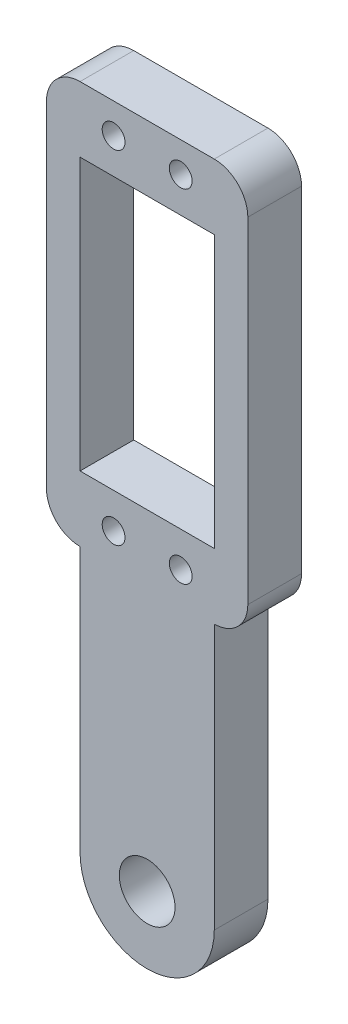
ISO-10303-21;
HEADER;
FILE_DESCRIPTION(('STEP AP214'),'2;1');
FILE_NAME('part.step','',(''),(''),'','','');
FILE_SCHEMA(('AUTOMOTIVE_DESIGN { 1 0 10303 214 1 1 1 1 }'));
ENDSEC;
DATA;
#1=APPLICATION_CONTEXT('core data for automotive mechanical design processes');
#2=APPLICATION_PROTOCOL_DEFINITION('international standard','automotive_design',2000,#1);
#3=PRODUCT_CONTEXT('',#1,'mechanical');
#4=PRODUCT('Part','Part','',(#3));
#5=PRODUCT_RELATED_PRODUCT_CATEGORY('part','',(#4));
#6=PRODUCT_DEFINITION_FORMATION('','',#4);
#7=PRODUCT_DEFINITION_CONTEXT('part definition',#1,'design');
#8=PRODUCT_DEFINITION('design','',#6,#7);
#9=PRODUCT_DEFINITION_SHAPE('','',#8);
#10=(LENGTH_UNIT() NAMED_UNIT(*) SI_UNIT(.MILLI.,.METRE.));
#11=(NAMED_UNIT(*) PLANE_ANGLE_UNIT() SI_UNIT($,.RADIAN.));
#12=(NAMED_UNIT(*) SI_UNIT($,.STERADIAN.) SOLID_ANGLE_UNIT());
#13=UNCERTAINTY_MEASURE_WITH_UNIT(LENGTH_MEASURE(1.E-05),#10,'distance_accuracy_value','');
#14=(GEOMETRIC_REPRESENTATION_CONTEXT(3) GLOBAL_UNCERTAINTY_ASSIGNED_CONTEXT((#13)) GLOBAL_UNIT_ASSIGNED_CONTEXT((#10,
#11,#12)) REPRESENTATION_CONTEXT('',''));
#15=CARTESIAN_POINT('',(0.,0.,0.));
#16=DIRECTION('',(0.,0.,1.));
#17=DIRECTION('',(1.,0.,0.));
#18=AXIS2_PLACEMENT_3D('',#15,#16,#17);
#19=CARTESIAN_POINT('',(0.,89.7500000000027,8.));
#20=DIRECTION('',(0.,1.00000000000004,0.));
#21=DIRECTION('',(0.,0.,1.));
#22=AXIS2_PLACEMENT_3D('',#19,#20,#21);
#23=PLANE('',#22);
#24=DIRECTION('',(1.00000000000004,0.,0.));
#25=VECTOR('',#24,1.);
#26=CARTESIAN_POINT('',(0.,89.7500000000027,0.));
#27=LINE('',#26,#25);
#28=CARTESIAN_POINT('',(-10.,89.7500000000027,0.));
#29=VERTEX_POINT('',#28);
#30=CARTESIAN_POINT('',(10.,89.7500000000027,0.));
#31=VERTEX_POINT('',#30);
#32=EDGE_CURVE('E222',#29,#31,#27,.T.);
#33=ORIENTED_EDGE('',*,*,#32,.T.);
#34=DIRECTION('',(0.,0.,-1.));
#35=VECTOR('',#34,1.);
#36=CARTESIAN_POINT('',(10.,89.7500000000027,8.));
#37=LINE('',#36,#35);
#38=CARTESIAN_POINT('',(10.,89.7500000000027,8.));
#39=VERTEX_POINT('',#38);
#40=EDGE_CURVE('E171',#39,#31,#37,.T.);
#41=ORIENTED_EDGE('',*,*,#40,.F.);
#42=DIRECTION('',(1.00000000000004,0.,0.));
#43=VECTOR('',#42,1.);
#44=CARTESIAN_POINT('',(0.,89.7500000000027,8.));
#45=LINE('',#44,#43);
#46=CARTESIAN_POINT('',(-10.,89.7500000000027,8.));
#47=VERTEX_POINT('',#46);
#48=EDGE_CURVE('E279',#47,#39,#45,.T.);
#49=ORIENTED_EDGE('',*,*,#48,.F.);
#50=DIRECTION('',(0.,0.,-1.));
#51=VECTOR('',#50,1.);
#52=CARTESIAN_POINT('',(-10.,89.7500000000027,8.));
#53=LINE('',#52,#51);
#54=EDGE_CURVE('E160',#47,#29,#53,.T.);
#55=ORIENTED_EDGE('',*,*,#54,.T.);
#56=EDGE_LOOP('',(#33,#41,#49,#55));
#57=FACE_BOUND('',#56,.T.);
#58=ADVANCED_FACE('F36',(#57),#23,.F.);
#59=CARTESIAN_POINT('',(10.,0.,8.));
#60=DIRECTION('',(1.00000000000004,0.,0.));
#61=DIRECTION('',(0.,0.,-1.));
#62=AXIS2_PLACEMENT_3D('',#59,#60,#61);
#63=PLANE('',#62);
#64=DIRECTION('',(0.,-1.00000000000004,0.));
#65=VECTOR('',#64,1.);
#66=CARTESIAN_POINT('',(10.,0.,0.));
#67=LINE('',#66,#65);
#68=CARTESIAN_POINT('',(10.,49.2500000000027,0.));
#69=VERTEX_POINT('',#68);
#70=EDGE_CURVE('E225',#31,#69,#67,.T.);
#71=ORIENTED_EDGE('',*,*,#70,.T.);
#72=DIRECTION('',(0.,0.,-1.));
#73=VECTOR('',#72,1.);
#74=CARTESIAN_POINT('',(10.,49.2500000000027,8.));
#75=LINE('',#74,#73);
#76=CARTESIAN_POINT('',(10.,49.2500000000027,8.));
#77=VERTEX_POINT('',#76);
#78=EDGE_CURVE('E242',#77,#69,#75,.T.);
#79=ORIENTED_EDGE('',*,*,#78,.F.);
#80=DIRECTION('',(0.,-1.00000000000004,0.));
#81=VECTOR('',#80,1.);
#82=CARTESIAN_POINT('',(10.,0.,8.));
#83=LINE('',#82,#81);
#84=EDGE_CURVE('E282',#39,#77,#83,.T.);
#85=ORIENTED_EDGE('',*,*,#84,.F.);
#86=ORIENTED_EDGE('',*,*,#40,.T.);
#87=EDGE_LOOP('',(#71,#79,#85,#86));
#88=FACE_BOUND('',#87,.T.);
#89=ADVANCED_FACE('F322',(#88),#63,.F.);
#90=CARTESIAN_POINT('',(0.,49.2500000000027,8.));
#91=DIRECTION('',(0.,1.00000000000004,0.));
#92=DIRECTION('',(0.,0.,1.));
#93=AXIS2_PLACEMENT_3D('',#90,#91,#92);
#94=PLANE('',#93);
#95=DIRECTION('',(1.00000000000004,0.,0.));
#96=VECTOR('',#95,1.);
#97=CARTESIAN_POINT('',(0.,49.2500000000027,0.));
#98=LINE('',#97,#96);
#99=CARTESIAN_POINT('',(-10.,49.2500000000027,0.));
#100=VERTEX_POINT('',#99);
#101=EDGE_CURVE('E228',#100,#69,#98,.T.);
#102=ORIENTED_EDGE('',*,*,#101,.F.);
#103=DIRECTION('',(0.,0.,-1.));
#104=VECTOR('',#103,1.);
#105=CARTESIAN_POINT('',(-10.,49.2500000000027,8.));
#106=LINE('',#105,#104);
#107=CARTESIAN_POINT('',(-10.,49.2500000000027,8.));
#108=VERTEX_POINT('',#107);
#109=EDGE_CURVE('E162',#108,#100,#106,.T.);
#110=ORIENTED_EDGE('',*,*,#109,.F.);
#111=DIRECTION('',(1.00000000000004,0.,0.));
#112=VECTOR('',#111,1.);
#113=CARTESIAN_POINT('',(0.,49.2500000000027,8.));
#114=LINE('',#113,#112);
#115=EDGE_CURVE('E284',#108,#77,#114,.T.);
#116=ORIENTED_EDGE('',*,*,#115,.T.);
#117=ORIENTED_EDGE('',*,*,#78,.T.);
#118=EDGE_LOOP('',(#102,#110,#116,#117));
#119=FACE_BOUND('',#118,.T.);
#120=ADVANCED_FACE('F328',(#119),#94,.T.);
#121=CARTESIAN_POINT('',(15.,0.,8.));
#122=DIRECTION('',(1.00000000000004,0.,0.));
#123=DIRECTION('',(0.,0.,-1.));
#124=AXIS2_PLACEMENT_3D('',#121,#122,#123);
#125=PLANE('',#124);
#126=DIRECTION('',(0.,-1.00000000000004,0.));
#127=VECTOR('',#126,1.);
#128=CARTESIAN_POINT('',(15.,0.,8.));
#129=LINE('',#128,#127);
#130=CARTESIAN_POINT('',(15.,94.5000000000041,8.));
#131=VERTEX_POINT('',#130);
#132=CARTESIAN_POINT('',(15.,44.5000000000014,8.));
#133=VERTEX_POINT('',#132);
#134=EDGE_CURVE('E267',#131,#133,#129,.T.);
#135=ORIENTED_EDGE('',*,*,#134,.T.);
#136=DIRECTION('',(0.,0.,-1.));
#137=VECTOR('',#136,1.);
#138=CARTESIAN_POINT('',(15.,44.5000000000014,0.));
#139=LINE('',#138,#137);
#140=CARTESIAN_POINT('',(15.,44.5000000000014,0.));
#141=VERTEX_POINT('',#140);
#142=EDGE_CURVE('E170',#133,#141,#139,.T.);
#143=ORIENTED_EDGE('',*,*,#142,.T.);
#144=DIRECTION('',(0.,-1.00000000000004,0.));
#145=VECTOR('',#144,1.);
#146=CARTESIAN_POINT('',(15.,0.,0.));
#147=LINE('',#146,#145);
#148=CARTESIAN_POINT('',(15.,94.5000000000041,0.));
#149=VERTEX_POINT('',#148);
#150=EDGE_CURVE('E207',#149,#141,#147,.T.);
#151=ORIENTED_EDGE('',*,*,#150,.F.);
#152=DIRECTION('',(0.,0.,-1.));
#153=VECTOR('',#152,1.);
#154=CARTESIAN_POINT('',(15.,94.5000000000041,8.));
#155=LINE('',#154,#153);
#156=EDGE_CURVE('E168',#149,#131,#155,.F.);
#157=ORIENTED_EDGE('',*,*,#156,.T.);
#158=EDGE_LOOP('',(#135,#143,#151,#157));
#159=FACE_BOUND('',#158,.T.);
#160=ADVANCED_FACE('F264',(#159),#125,.T.);
#161=CARTESIAN_POINT('',(0.,99.5000000000054,8.));
#162=DIRECTION('',(0.,1.00000000000004,0.));
#163=DIRECTION('',(0.,0.,1.));
#164=AXIS2_PLACEMENT_3D('',#161,#162,#163);
#165=PLANE('',#164);
#166=DIRECTION('',(1.00000000000004,0.,0.));
#167=VECTOR('',#166,1.);
#168=CARTESIAN_POINT('',(0.,99.5000000000054,0.));
#169=LINE('',#168,#167);
#170=CARTESIAN_POINT('',(-10.,99.5000000000054,0.));
#171=VERTEX_POINT('',#170);
#172=CARTESIAN_POINT('',(10.,99.5000000000054,0.));
#173=VERTEX_POINT('',#172);
#174=EDGE_CURVE('E195',#171,#173,#169,.T.);
#175=ORIENTED_EDGE('',*,*,#174,.F.);
#176=DIRECTION('',(0.,0.,-1.));
#177=VECTOR('',#176,1.);
#178=CARTESIAN_POINT('',(-10.,99.5000000000054,8.));
#179=LINE('',#178,#177);
#180=CARTESIAN_POINT('',(-10.,99.5000000000054,8.));
#181=VERTEX_POINT('',#180);
#182=EDGE_CURVE('E11',#171,#181,#179,.F.);
#183=ORIENTED_EDGE('',*,*,#182,.T.);
#184=DIRECTION('',(1.00000000000004,0.,0.));
#185=VECTOR('',#184,1.);
#186=CARTESIAN_POINT('',(0.,99.5000000000054,8.));
#187=LINE('',#186,#185);
#188=CARTESIAN_POINT('',(10.,99.5000000000054,8.));
#189=VERTEX_POINT('',#188);
#190=EDGE_CURVE('E197',#181,#189,#187,.T.);
#191=ORIENTED_EDGE('',*,*,#190,.T.);
#192=DIRECTION('',(0.,0.,-1.));
#193=VECTOR('',#192,1.);
#194=CARTESIAN_POINT('',(10.,99.5000000000054,8.));
#195=LINE('',#194,#193);
#196=EDGE_CURVE('E44',#189,#173,#195,.T.);
#197=ORIENTED_EDGE('',*,*,#196,.T.);
#198=EDGE_LOOP('',(#175,#183,#191,#197));
#199=FACE_BOUND('',#198,.T.);
#200=ADVANCED_FACE('F194',(#199),#165,.T.);
#201=CARTESIAN_POINT('',(-15.,0.,8.));
#202=DIRECTION('',(1.00000000000004,0.,0.));
#203=DIRECTION('',(0.,0.,-1.));
#204=AXIS2_PLACEMENT_3D('',#201,#202,#203);
#205=PLANE('',#204);
#206=DIRECTION('',(0.,-1.00000000000004,0.));
#207=VECTOR('',#206,1.);
#208=CARTESIAN_POINT('',(-15.,0.,0.));
#209=LINE('',#208,#207);
#210=CARTESIAN_POINT('',(-15.,94.5000000000041,0.));
#211=VERTEX_POINT('',#210);
#212=CARTESIAN_POINT('',(-15.,44.5000000000014,0.));
#213=VERTEX_POINT('',#212);
#214=EDGE_CURVE('E206',#211,#213,#209,.T.);
#215=ORIENTED_EDGE('',*,*,#214,.T.);
#216=DIRECTION('',(0.,0.,-1.));
#217=VECTOR('',#216,1.);
#218=CARTESIAN_POINT('',(-15.,44.5000000000014,8.));
#219=LINE('',#218,#217);
#220=CARTESIAN_POINT('',(-15.,44.5000000000014,8.));
#221=VERTEX_POINT('',#220);
#222=EDGE_CURVE('E51',#213,#221,#219,.F.);
#223=ORIENTED_EDGE('',*,*,#222,.T.);
#224=DIRECTION('',(0.,-1.00000000000004,0.));
#225=VECTOR('',#224,1.);
#226=CARTESIAN_POINT('',(-15.,0.,8.));
#227=LINE('',#226,#225);
#228=CARTESIAN_POINT('',(-15.,94.5000000000041,8.));
#229=VERTEX_POINT('',#228);
#230=EDGE_CURVE('E143',#229,#221,#227,.T.);
#231=ORIENTED_EDGE('',*,*,#230,.F.);
#232=DIRECTION('',(0.,0.,-1.));
#233=VECTOR('',#232,1.);
#234=CARTESIAN_POINT('',(-15.,94.5000000000041,0.));
#235=LINE('',#234,#233);
#236=EDGE_CURVE('E185',#229,#211,#235,.T.);
#237=ORIENTED_EDGE('',*,*,#236,.T.);
#238=EDGE_LOOP('',(#215,#223,#231,#237));
#239=FACE_BOUND('',#238,.T.);
#240=ADVANCED_FACE('F339',(#239),#205,.F.);
#241=CARTESIAN_POINT('',(-10.,0.,8.));
#242=DIRECTION('',(-1.00000000000004,0.,0.));
#243=DIRECTION('',(0.,0.,1.));
#244=AXIS2_PLACEMENT_3D('',#241,#242,#243);
#245=PLANE('',#244);
#246=DIRECTION('',(0.,1.00000000000004,0.));
#247=VECTOR('',#246,1.);
#248=CARTESIAN_POINT('',(-10.,0.,0.));
#249=LINE('',#248,#247);
#250=CARTESIAN_POINT('',(-10.,0.,0.));
#251=VERTEX_POINT('',#250);
#252=CARTESIAN_POINT('',(-10.,39.5000000000014,0.));
#253=VERTEX_POINT('',#252);
#254=EDGE_CURVE('E209',#251,#253,#249,.T.);
#255=ORIENTED_EDGE('',*,*,#254,.F.);
#256=DIRECTION('',(0.,0.,-1.));
#257=VECTOR('',#256,1.);
#258=CARTESIAN_POINT('',(-10.,0.,8.));
#259=LINE('',#258,#257);
#260=CARTESIAN_POINT('',(-10.,0.,8.));
#261=VERTEX_POINT('',#260);
#262=EDGE_CURVE('E154',#261,#251,#259,.T.);
#263=ORIENTED_EDGE('',*,*,#262,.F.);
#264=DIRECTION('',(0.,1.00000000000004,0.));
#265=VECTOR('',#264,1.);
#266=CARTESIAN_POINT('',(-10.,0.,8.));
#267=LINE('',#266,#265);
#268=CARTESIAN_POINT('',(-10.,39.5000000000014,8.));
#269=VERTEX_POINT('',#268);
#270=EDGE_CURVE('E142',#261,#269,#267,.T.);
#271=ORIENTED_EDGE('',*,*,#270,.T.);
#272=DIRECTION('',(0.,0.,-1.));
#273=VECTOR('',#272,1.);
#274=CARTESIAN_POINT('',(-10.,39.5000000000014,8.));
#275=LINE('',#274,#273);
#276=EDGE_CURVE('E152',#269,#253,#275,.T.);
#277=ORIENTED_EDGE('',*,*,#276,.T.);
#278=EDGE_LOOP('',(#255,#263,#271,#277));
#279=FACE_BOUND('',#278,.T.);
#280=ADVANCED_FACE('F151',(#279),#245,.T.);
#281=CARTESIAN_POINT('',(0.,0.,8.));
#282=DIRECTION('',(0.,0.,-1.));
#283=DIRECTION('',(-1.00000000000004,0.,0.));
#284=AXIS2_PLACEMENT_3D('',#281,#282,#283);
#285=CYLINDRICAL_SURFACE('',#284,10.);
#286=CARTESIAN_POINT('',(0.,0.,0.));
#287=DIRECTION('',(0.,0.,1.));
#288=DIRECTION('',(1.00000000000004,0.,0.));
#289=AXIS2_PLACEMENT_3D('',#286,#287,#288);
#290=CIRCLE('',#289,10.);
#291=CARTESIAN_POINT('',(10.,0.,0.));
#292=VERTEX_POINT('',#291);
#293=EDGE_CURVE('E216',#251,#292,#290,.T.);
#294=ORIENTED_EDGE('',*,*,#293,.T.);
#295=DIRECTION('',(0.,0.,-1.));
#296=VECTOR('',#295,1.);
#297=CARTESIAN_POINT('',(10.,0.,8.));
#298=LINE('',#297,#296);
#299=CARTESIAN_POINT('',(10.,0.,8.));
#300=VERTEX_POINT('',#299);
#301=EDGE_CURVE('E164',#300,#292,#298,.T.);
#302=ORIENTED_EDGE('',*,*,#301,.F.);
#303=CARTESIAN_POINT('',(0.,0.,8.));
#304=DIRECTION('',(0.,0.,1.));
#305=DIRECTION('',(1.00000000000004,0.,0.));
#306=AXIS2_PLACEMENT_3D('',#303,#304,#305);
#307=CIRCLE('',#306,10.);
#308=EDGE_CURVE('E156',#261,#300,#307,.T.);
#309=ORIENTED_EDGE('',*,*,#308,.F.);
#310=ORIENTED_EDGE('',*,*,#262,.T.);
#311=EDGE_LOOP('',(#294,#302,#309,#310));
#312=FACE_BOUND('',#311,.T.);
#313=ADVANCED_FACE('F257',(#312),#285,.T.);
#314=CARTESIAN_POINT('',(10.,0.,8.));
#315=DIRECTION('',(-1.00000000000004,0.,0.));
#316=DIRECTION('',(0.,0.,1.));
#317=AXIS2_PLACEMENT_3D('',#314,#315,#316);
#318=PLANE('',#317);
#319=DIRECTION('',(0.,1.00000000000004,0.));
#320=VECTOR('',#319,1.);
#321=CARTESIAN_POINT('',(10.,0.,0.));
#322=LINE('',#321,#320);
#323=CARTESIAN_POINT('',(10.,39.5000000000014,0.));
#324=VERTEX_POINT('',#323);
#325=EDGE_CURVE('E219',#292,#324,#322,.T.);
#326=ORIENTED_EDGE('',*,*,#325,.T.);
#327=DIRECTION('',(0.,0.,-1.));
#328=VECTOR('',#327,1.);
#329=CARTESIAN_POINT('',(10.,39.5000000000014,8.));
#330=LINE('',#329,#328);
#331=CARTESIAN_POINT('',(10.,39.5000000000014,8.));
#332=VERTEX_POINT('',#331);
#333=EDGE_CURVE('E246',#332,#324,#330,.T.);
#334=ORIENTED_EDGE('',*,*,#333,.F.);
#335=DIRECTION('',(0.,1.00000000000004,0.));
#336=VECTOR('',#335,1.);
#337=CARTESIAN_POINT('',(10.,0.,8.));
#338=LINE('',#337,#336);
#339=EDGE_CURVE('E254',#300,#332,#338,.T.);
#340=ORIENTED_EDGE('',*,*,#339,.F.);
#341=ORIENTED_EDGE('',*,*,#301,.T.);
#342=EDGE_LOOP('',(#326,#334,#340,#341));
#343=FACE_BOUND('',#342,.T.);
#344=ADVANCED_FACE('F252',(#343),#318,.F.);
#345=CARTESIAN_POINT('',(5.,44.0000000000013,8.));
#346=DIRECTION('',(0.,0.,-1.));
#347=DIRECTION('',(-1.00000000000004,0.,0.));
#348=AXIS2_PLACEMENT_3D('',#345,#346,#347);
#349=CYLINDRICAL_SURFACE('',#348,1.7);
#350=CARTESIAN_POINT('',(5.,44.0000000000013,8.));
#351=DIRECTION('',(0.,0.,1.));
#352=DIRECTION('',(1.00000000000004,0.,0.));
#353=AXIS2_PLACEMENT_3D('',#350,#351,#352);
#354=CIRCLE('',#353,1.7);
#355=CARTESIAN_POINT('',(6.70000000000008,44.0000000000013,8.));
#356=VERTEX_POINT('',#355);
#357=EDGE_CURVE('E290',#356,#356,#354,.F.);
#358=ORIENTED_EDGE('',*,*,#357,.F.);
#359=EDGE_LOOP('',(#358));
#360=FACE_BOUND('',#359,.T.);
#361=CARTESIAN_POINT('',(5.,44.0000000000013,0.));
#362=DIRECTION('',(0.,0.,1.));
#363=DIRECTION('',(1.00000000000004,0.,0.));
#364=AXIS2_PLACEMENT_3D('',#361,#362,#363);
#365=CIRCLE('',#364,1.7);
#366=CARTESIAN_POINT('',(6.70000000000008,44.0000000000013,0.));
#367=VERTEX_POINT('',#366);
#368=EDGE_CURVE('E234',#367,#367,#365,.F.);
#369=ORIENTED_EDGE('',*,*,#368,.T.);
#370=EDGE_LOOP('',(#369));
#371=FACE_BOUND('',#370,.T.);
#372=ADVANCED_FACE('F317',(#360,#371),#349,.F.);
#373=CARTESIAN_POINT('',(-10.,0.,8.));
#374=DIRECTION('',(1.00000000000004,0.,0.));
#375=DIRECTION('',(0.,0.,-1.));
#376=AXIS2_PLACEMENT_3D('',#373,#374,#375);
#377=PLANE('',#376);
#378=DIRECTION('',(0.,-1.00000000000004,0.));
#379=VECTOR('',#378,1.);
#380=CARTESIAN_POINT('',(-10.,0.,0.));
#381=LINE('',#380,#379);
#382=EDGE_CURVE('E231',#29,#100,#381,.T.);
#383=ORIENTED_EDGE('',*,*,#382,.F.);
#384=ORIENTED_EDGE('',*,*,#54,.F.);
#385=DIRECTION('',(0.,-1.00000000000004,0.));
#386=VECTOR('',#385,1.);
#387=CARTESIAN_POINT('',(-10.,0.,8.));
#388=LINE('',#387,#386);
#389=EDGE_CURVE('E287',#47,#108,#388,.T.);
#390=ORIENTED_EDGE('',*,*,#389,.T.);
#391=ORIENTED_EDGE('',*,*,#109,.T.);
#392=EDGE_LOOP('',(#383,#384,#390,#391));
#393=FACE_BOUND('',#392,.T.);
#394=ADVANCED_FACE('F307',(#393),#377,.T.);
#395=CARTESIAN_POINT('',(-5.,95.0000000000041,8.));
#396=DIRECTION('',(0.,0.,-1.));
#397=DIRECTION('',(-1.00000000000004,0.,0.));
#398=AXIS2_PLACEMENT_3D('',#395,#396,#397);
#399=CYLINDRICAL_SURFACE('',#398,1.7);
#400=CARTESIAN_POINT('',(-5.,95.0000000000041,8.));
#401=DIRECTION('',(0.,0.,1.));
#402=DIRECTION('',(1.00000000000004,0.,0.));
#403=AXIS2_PLACEMENT_3D('',#400,#401,#402);
#404=CIRCLE('',#403,1.7);
#405=CARTESIAN_POINT('',(-3.29999999999993,95.0000000000041,8.));
#406=VERTEX_POINT('',#405);
#407=EDGE_CURVE('E268',#406,#406,#404,.T.);
#408=ORIENTED_EDGE('',*,*,#407,.T.);
#409=EDGE_LOOP('',(#408));
#410=FACE_BOUND('',#409,.T.);
#411=CARTESIAN_POINT('',(-5.,95.0000000000041,0.));
#412=DIRECTION('',(0.,0.,1.));
#413=DIRECTION('',(1.00000000000004,0.,0.));
#414=AXIS2_PLACEMENT_3D('',#411,#412,#413);
#415=CIRCLE('',#414,1.7);
#416=CARTESIAN_POINT('',(-3.29999999999993,95.0000000000041,0.));
#417=VERTEX_POINT('',#416);
#418=EDGE_CURVE('E211',#417,#417,#415,.T.);
#419=ORIENTED_EDGE('',*,*,#418,.F.);
#420=EDGE_LOOP('',(#419));
#421=FACE_BOUND('',#420,.T.);
#422=ADVANCED_FACE('F304',(#410,#421),#399,.F.);
#423=CARTESIAN_POINT('',(5.,95.0000000000041,8.));
#424=DIRECTION('',(0.,0.,-1.));
#425=DIRECTION('',(-1.00000000000004,0.,0.));
#426=AXIS2_PLACEMENT_3D('',#423,#424,#425);
#427=CYLINDRICAL_SURFACE('',#426,1.7);
#428=CARTESIAN_POINT('',(5.,95.0000000000041,8.));
#429=DIRECTION('',(0.,0.,1.));
#430=DIRECTION('',(1.00000000000004,0.,0.));
#431=AXIS2_PLACEMENT_3D('',#428,#429,#430);
#432=CIRCLE('',#431,1.7);
#433=CARTESIAN_POINT('',(6.70000000000008,95.0000000000041,8.));
#434=VERTEX_POINT('',#433);
#435=EDGE_CURVE('E272',#434,#434,#432,.T.);
#436=ORIENTED_EDGE('',*,*,#435,.T.);
#437=EDGE_LOOP('',(#436));
#438=FACE_BOUND('',#437,.T.);
#439=CARTESIAN_POINT('',(5.,95.0000000000041,0.));
#440=DIRECTION('',(0.,0.,1.));
#441=DIRECTION('',(1.00000000000004,0.,0.));
#442=AXIS2_PLACEMENT_3D('',#439,#440,#441);
#443=CIRCLE('',#442,1.7);
#444=CARTESIAN_POINT('',(6.70000000000008,95.0000000000041,0.));
#445=VERTEX_POINT('',#444);
#446=EDGE_CURVE('E298',#445,#445,#443,.T.);
#447=ORIENTED_EDGE('',*,*,#446,.F.);
#448=EDGE_LOOP('',(#447));
#449=FACE_BOUND('',#448,.T.);
#450=ADVANCED_FACE('F306',(#438,#449),#427,.F.);
#451=CARTESIAN_POINT('',(-5.,44.0000000000013,8.));
#452=DIRECTION('',(0.,0.,-1.));
#453=DIRECTION('',(-1.00000000000004,0.,0.));
#454=AXIS2_PLACEMENT_3D('',#451,#452,#453);
#455=CYLINDRICAL_SURFACE('',#454,1.7);
#456=CARTESIAN_POINT('',(-5.,44.0000000000013,8.));
#457=DIRECTION('',(0.,0.,1.));
#458=DIRECTION('',(1.00000000000004,0.,0.));
#459=AXIS2_PLACEMENT_3D('',#456,#457,#458);
#460=CIRCLE('',#459,1.7);
#461=CARTESIAN_POINT('',(-3.29999999999993,44.0000000000013,8.));
#462=VERTEX_POINT('',#461);
#463=EDGE_CURVE('E239',#462,#462,#460,.F.);
#464=ORIENTED_EDGE('',*,*,#463,.F.);
#465=EDGE_LOOP('',(#464));
#466=FACE_BOUND('',#465,.T.);
#467=CARTESIAN_POINT('',(-5.,44.0000000000013,0.));
#468=DIRECTION('',(0.,0.,1.));
#469=DIRECTION('',(1.00000000000004,0.,0.));
#470=AXIS2_PLACEMENT_3D('',#467,#468,#469);
#471=CIRCLE('',#470,1.7);
#472=CARTESIAN_POINT('',(-3.29999999999993,44.0000000000013,0.));
#473=VERTEX_POINT('',#472);
#474=EDGE_CURVE('E295',#473,#473,#471,.F.);
#475=ORIENTED_EDGE('',*,*,#474,.T.);
#476=EDGE_LOOP('',(#475));
#477=FACE_BOUND('',#476,.T.);
#478=ADVANCED_FACE('F314',(#466,#477),#455,.F.);
#479=CARTESIAN_POINT('',(0.,0.,8.));
#480=DIRECTION('',(0.,0.,-1.));
#481=DIRECTION('',(-1.00000000000004,0.,0.));
#482=AXIS2_PLACEMENT_3D('',#479,#480,#481);
#483=CYLINDRICAL_SURFACE('',#482,4.15);
#484=CARTESIAN_POINT('',(0.,0.,8.));
#485=DIRECTION('',(0.,0.,1.));
#486=DIRECTION('',(1.00000000000004,0.,0.));
#487=AXIS2_PLACEMENT_3D('',#484,#485,#486);
#488=CIRCLE('',#487,4.15);
#489=CARTESIAN_POINT('',(4.15000000000018,0.,8.));
#490=VERTEX_POINT('',#489);
#491=EDGE_CURVE('E248',#490,#490,#488,.T.);
#492=ORIENTED_EDGE('',*,*,#491,.T.);
#493=EDGE_LOOP('',(#492));
#494=FACE_BOUND('',#493,.T.);
#495=CARTESIAN_POINT('',(0.,0.,0.));
#496=DIRECTION('',(0.,0.,1.));
#497=DIRECTION('',(1.00000000000004,0.,0.));
#498=AXIS2_PLACEMENT_3D('',#495,#496,#497);
#499=CIRCLE('',#498,4.15);
#500=CARTESIAN_POINT('',(4.15000000000018,0.,0.));
#501=VERTEX_POINT('',#500);
#502=EDGE_CURVE('E237',#501,#501,#499,.T.);
#503=ORIENTED_EDGE('',*,*,#502,.F.);
#504=EDGE_LOOP('',(#503));
#505=FACE_BOUND('',#504,.T.);
#506=ADVANCED_FACE('F355',(#494,#505),#483,.F.);
#507=CARTESIAN_POINT('',(0.,0.,8.));
#508=DIRECTION('',(0.,0.,1.));
#509=DIRECTION('',(1.00000000000004,0.,0.));
#510=AXIS2_PLACEMENT_3D('',#507,#508,#509);
#511=PLANE('',#510);
#512=ORIENTED_EDGE('',*,*,#463,.T.);
#513=EDGE_LOOP('',(#512));
#514=FACE_BOUND('',#513,.T.);
#515=ORIENTED_EDGE('',*,*,#435,.F.);
#516=EDGE_LOOP('',(#515));
#517=FACE_BOUND('',#516,.T.);
#518=ORIENTED_EDGE('',*,*,#407,.F.);
#519=EDGE_LOOP('',(#518));
#520=FACE_BOUND('',#519,.T.);
#521=ORIENTED_EDGE('',*,*,#339,.T.);
#522=CARTESIAN_POINT('',(10.,44.5000000000014,8.));
#523=DIRECTION('',(0.,0.,1.));
#524=DIRECTION('',(1.00000000000004,0.,0.));
#525=AXIS2_PLACEMENT_3D('',#522,#523,#524);
#526=CIRCLE('',#525,5.);
#527=EDGE_CURVE('E146',#332,#133,#526,.T.);
#528=ORIENTED_EDGE('',*,*,#527,.T.);
#529=ORIENTED_EDGE('',*,*,#134,.F.);
#530=CARTESIAN_POINT('',(10.,94.5000000000041,8.));
#531=DIRECTION('',(0.,0.,1.));
#532=DIRECTION('',(1.00000000000004,0.,0.));
#533=AXIS2_PLACEMENT_3D('',#530,#531,#532);
#534=CIRCLE('',#533,5.);
#535=EDGE_CURVE('E181',#131,#189,#534,.T.);
#536=ORIENTED_EDGE('',*,*,#535,.T.);
#537=ORIENTED_EDGE('',*,*,#190,.F.);
#538=CARTESIAN_POINT('',(-10.,94.5000000000041,8.));
#539=DIRECTION('',(0.,0.,1.));
#540=DIRECTION('',(1.00000000000004,0.,0.));
#541=AXIS2_PLACEMENT_3D('',#538,#539,#540);
#542=CIRCLE('',#541,5.);
#543=EDGE_CURVE('E58',#181,#229,#542,.T.);
#544=ORIENTED_EDGE('',*,*,#543,.T.);
#545=ORIENTED_EDGE('',*,*,#230,.T.);
#546=CARTESIAN_POINT('',(-10.,44.5000000000014,8.));
#547=DIRECTION('',(0.,0.,1.));
#548=DIRECTION('',(1.00000000000004,0.,0.));
#549=AXIS2_PLACEMENT_3D('',#546,#547,#548);
#550=CIRCLE('',#549,5.);
#551=EDGE_CURVE('E137',#221,#269,#550,.T.);
#552=ORIENTED_EDGE('',*,*,#551,.T.);
#553=ORIENTED_EDGE('',*,*,#270,.F.);
#554=ORIENTED_EDGE('',*,*,#308,.T.);
#555=EDGE_LOOP('',(#521,#528,#529,#536,#537,#544,#545,#552,#553,#554));
#556=FACE_BOUND('',#555,.T.);
#557=ORIENTED_EDGE('',*,*,#48,.T.);
#558=ORIENTED_EDGE('',*,*,#84,.T.);
#559=ORIENTED_EDGE('',*,*,#115,.F.);
#560=ORIENTED_EDGE('',*,*,#389,.F.);
#561=EDGE_LOOP('',(#557,#558,#559,#560));
#562=FACE_BOUND('',#561,.T.);
#563=ORIENTED_EDGE('',*,*,#357,.T.);
#564=EDGE_LOOP('',(#563));
#565=FACE_BOUND('',#564,.T.);
#566=ORIENTED_EDGE('',*,*,#491,.F.);
#567=EDGE_LOOP('',(#566));
#568=FACE_BOUND('',#567,.T.);
#569=ADVANCED_FACE('F139',(#514,#517,#520,#556,#562,#565,#568),#511,.T.);
#570=CARTESIAN_POINT('',(0.,0.,0.));
#571=DIRECTION('',(0.,0.,1.));
#572=DIRECTION('',(1.00000000000004,0.,0.));
#573=AXIS2_PLACEMENT_3D('',#570,#571,#572);
#574=PLANE('',#573);
#575=ORIENTED_EDGE('',*,*,#474,.F.);
#576=EDGE_LOOP('',(#575));
#577=FACE_BOUND('',#576,.T.);
#578=ORIENTED_EDGE('',*,*,#446,.T.);
#579=EDGE_LOOP('',(#578));
#580=FACE_BOUND('',#579,.T.);
#581=ORIENTED_EDGE('',*,*,#418,.T.);
#582=EDGE_LOOP('',(#581));
#583=FACE_BOUND('',#582,.T.);
#584=ORIENTED_EDGE('',*,*,#150,.T.);
#585=CARTESIAN_POINT('',(10.,44.5000000000014,0.));
#586=DIRECTION('',(0.,0.,1.));
#587=DIRECTION('',(1.00000000000004,0.,0.));
#588=AXIS2_PLACEMENT_3D('',#585,#586,#587);
#589=CIRCLE('',#588,5.);
#590=EDGE_CURVE('E179',#141,#324,#589,.F.);
#591=ORIENTED_EDGE('',*,*,#590,.T.);
#592=ORIENTED_EDGE('',*,*,#325,.F.);
#593=ORIENTED_EDGE('',*,*,#293,.F.);
#594=ORIENTED_EDGE('',*,*,#254,.T.);
#595=CARTESIAN_POINT('',(-10.,44.5000000000014,0.));
#596=DIRECTION('',(0.,0.,1.));
#597=DIRECTION('',(1.00000000000004,0.,0.));
#598=AXIS2_PLACEMENT_3D('',#595,#596,#597);
#599=CIRCLE('',#598,5.);
#600=EDGE_CURVE('E159',#253,#213,#599,.F.);
#601=ORIENTED_EDGE('',*,*,#600,.T.);
#602=ORIENTED_EDGE('',*,*,#214,.F.);
#603=CARTESIAN_POINT('',(-10.,94.5000000000041,0.));
#604=DIRECTION('',(0.,0.,1.));
#605=DIRECTION('',(1.00000000000004,0.,0.));
#606=AXIS2_PLACEMENT_3D('',#603,#604,#605);
#607=CIRCLE('',#606,5.);
#608=EDGE_CURVE('E176',#211,#171,#607,.F.);
#609=ORIENTED_EDGE('',*,*,#608,.T.);
#610=ORIENTED_EDGE('',*,*,#174,.T.);
#611=CARTESIAN_POINT('',(10.,94.5000000000041,0.));
#612=DIRECTION('',(0.,0.,1.));
#613=DIRECTION('',(1.00000000000004,0.,0.));
#614=AXIS2_PLACEMENT_3D('',#611,#612,#613);
#615=CIRCLE('',#614,5.);
#616=EDGE_CURVE('E174',#173,#149,#615,.F.);
#617=ORIENTED_EDGE('',*,*,#616,.T.);
#618=EDGE_LOOP('',(#584,#591,#592,#593,#594,#601,#602,#609,#610,#617));
#619=FACE_BOUND('',#618,.T.);
#620=ORIENTED_EDGE('',*,*,#32,.F.);
#621=ORIENTED_EDGE('',*,*,#382,.T.);
#622=ORIENTED_EDGE('',*,*,#101,.T.);
#623=ORIENTED_EDGE('',*,*,#70,.F.);
#624=EDGE_LOOP('',(#620,#621,#622,#623));
#625=FACE_BOUND('',#624,.T.);
#626=ORIENTED_EDGE('',*,*,#368,.F.);
#627=EDGE_LOOP('',(#626));
#628=FACE_BOUND('',#627,.T.);
#629=ORIENTED_EDGE('',*,*,#502,.T.);
#630=EDGE_LOOP('',(#629));
#631=FACE_BOUND('',#630,.T.);
#632=ADVANCED_FACE('F202',(#577,#580,#583,#619,#625,#628,#631),#574,.F.);
#633=CARTESIAN_POINT('',(10.,44.5000000000014,8.));
#634=DIRECTION('',(0.,0.,1.));
#635=DIRECTION('',(1.00000000000004,0.,0.));
#636=AXIS2_PLACEMENT_3D('',#633,#634,#635);
#637=CYLINDRICAL_SURFACE('',#636,5.);
#638=ORIENTED_EDGE('',*,*,#527,.F.);
#639=ORIENTED_EDGE('',*,*,#333,.T.);
#640=ORIENTED_EDGE('',*,*,#590,.F.);
#641=ORIENTED_EDGE('',*,*,#142,.F.);
#642=EDGE_LOOP('',(#638,#639,#640,#641));
#643=FACE_BOUND('',#642,.T.);
#644=ADVANCED_FACE('F261',(#643),#637,.T.);
#645=CARTESIAN_POINT('',(-10.,44.5000000000014,8.));
#646=DIRECTION('',(0.,0.,-1.));
#647=DIRECTION('',(-1.00000000000004,0.,0.));
#648=AXIS2_PLACEMENT_3D('',#645,#646,#647);
#649=CYLINDRICAL_SURFACE('',#648,5.);
#650=ORIENTED_EDGE('',*,*,#551,.F.);
#651=ORIENTED_EDGE('',*,*,#222,.F.);
#652=ORIENTED_EDGE('',*,*,#600,.F.);
#653=ORIENTED_EDGE('',*,*,#276,.F.);
#654=EDGE_LOOP('',(#650,#651,#652,#653));
#655=FACE_BOUND('',#654,.T.);
#656=ADVANCED_FACE('F158',(#655),#649,.T.);
#657=CARTESIAN_POINT('',(-10.,94.5000000000041,8.));
#658=DIRECTION('',(0.,0.,1.));
#659=DIRECTION('',(1.00000000000004,0.,0.));
#660=AXIS2_PLACEMENT_3D('',#657,#658,#659);
#661=CYLINDRICAL_SURFACE('',#660,5.);
#662=ORIENTED_EDGE('',*,*,#543,.F.);
#663=ORIENTED_EDGE('',*,*,#182,.F.);
#664=ORIENTED_EDGE('',*,*,#608,.F.);
#665=ORIENTED_EDGE('',*,*,#236,.F.);
#666=EDGE_LOOP('',(#662,#663,#664,#665));
#667=FACE_BOUND('',#666,.T.);
#668=ADVANCED_FACE('F388',(#667),#661,.T.);
#669=CARTESIAN_POINT('',(10.,94.5000000000041,8.));
#670=DIRECTION('',(0.,0.,-1.));
#671=DIRECTION('',(-1.00000000000004,0.,0.));
#672=AXIS2_PLACEMENT_3D('',#669,#670,#671);
#673=CYLINDRICAL_SURFACE('',#672,5.);
#674=ORIENTED_EDGE('',*,*,#535,.F.);
#675=ORIENTED_EDGE('',*,*,#156,.F.);
#676=ORIENTED_EDGE('',*,*,#616,.F.);
#677=ORIENTED_EDGE('',*,*,#196,.F.);
#678=EDGE_LOOP('',(#674,#675,#676,#677));
#679=FACE_BOUND('',#678,.T.);
#680=ADVANCED_FACE('F38',(#679),#673,.T.);
#681=CLOSED_SHELL('',(#58,#89,#120,#160,#200,#240,#280,#313,#344,#372,#394,#422,#450,#478,#506,
#569,#632,#644,#656,#668,#680));
#682=MANIFOLD_SOLID_BREP('B2',#681);
#683=ADVANCED_BREP_SHAPE_REPRESENTATION('',(#18,#682),#14);
#684=SHAPE_DEFINITION_REPRESENTATION(#9,#683);
ENDSEC;
END-ISO-10303-21;
